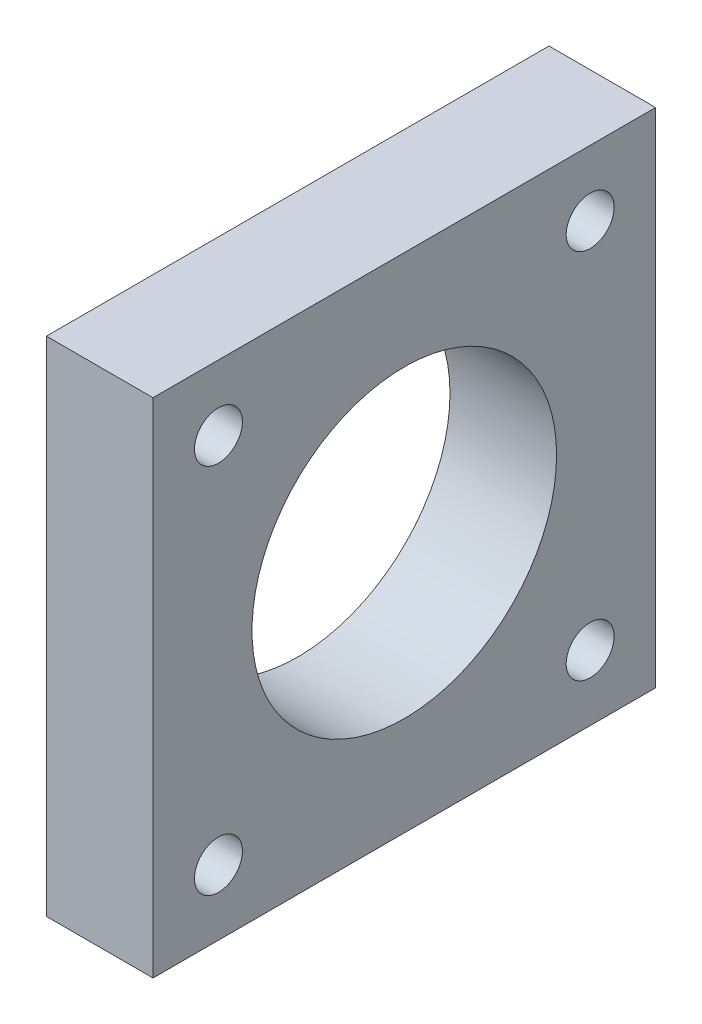
ISO-10303-21;
HEADER;
FILE_DESCRIPTION(('STEP AP214'),'2;1');
FILE_NAME('part.step','',(''),(''),'','','');
FILE_SCHEMA(('AUTOMOTIVE_DESIGN { 1 0 10303 214 1 1 1 1 }'));
ENDSEC;
DATA;
#1=APPLICATION_CONTEXT('core data for automotive mechanical design processes');
#2=APPLICATION_PROTOCOL_DEFINITION('international standard','automotive_design',2000,#1);
#3=PRODUCT_CONTEXT('',#1,'mechanical');
#4=PRODUCT('Part','Part','',(#3));
#5=PRODUCT_RELATED_PRODUCT_CATEGORY('part','',(#4));
#6=PRODUCT_DEFINITION_FORMATION('','',#4);
#7=PRODUCT_DEFINITION_CONTEXT('part definition',#1,'design');
#8=PRODUCT_DEFINITION('design','',#6,#7);
#9=PRODUCT_DEFINITION_SHAPE('','',#8);
#10=(LENGTH_UNIT() NAMED_UNIT(*) SI_UNIT(.MILLI.,.METRE.));
#11=(NAMED_UNIT(*) PLANE_ANGLE_UNIT() SI_UNIT($,.RADIAN.));
#12=(NAMED_UNIT(*) SI_UNIT($,.STERADIAN.) SOLID_ANGLE_UNIT());
#13=UNCERTAINTY_MEASURE_WITH_UNIT(LENGTH_MEASURE(1.E-05),#10,'distance_accuracy_value','');
#14=(GEOMETRIC_REPRESENTATION_CONTEXT(3) GLOBAL_UNCERTAINTY_ASSIGNED_CONTEXT((#13)) GLOBAL_UNIT_ASSIGNED_CONTEXT((#10,
#11,#12)) REPRESENTATION_CONTEXT('',''));
#15=CARTESIAN_POINT('',(0.,0.,0.));
#16=DIRECTION('',(0.,0.,1.));
#17=DIRECTION('',(1.,0.,0.));
#18=AXIS2_PLACEMENT_3D('',#15,#16,#17);
#19=CARTESIAN_POINT('',(8.89,20.955,0.));
#20=DIRECTION('',(0.,-1.,0.));
#21=DIRECTION('',(0.,0.,-1.));
#22=AXIS2_PLACEMENT_3D('',#19,#20,#21);
#23=PLANE('',#22);
#24=DIRECTION('',(0.,0.,1.));
#25=VECTOR('',#24,1.);
#26=CARTESIAN_POINT('',(0.,20.955,0.));
#27=LINE('',#26,#25);
#28=CARTESIAN_POINT('',(0.,20.955,-20.955));
#29=VERTEX_POINT('',#28);
#30=CARTESIAN_POINT('',(0.,20.955,20.955));
#31=VERTEX_POINT('',#30);
#32=EDGE_CURVE('E116',#29,#31,#27,.T.);
#33=ORIENTED_EDGE('',*,*,#32,.T.);
#34=DIRECTION('',(-1.,0.,0.));
#35=VECTOR('',#34,1.);
#36=CARTESIAN_POINT('',(8.89,20.955,20.955));
#37=LINE('',#36,#35);
#38=CARTESIAN_POINT('',(8.89,20.955,20.955));
#39=VERTEX_POINT('',#38);
#40=EDGE_CURVE('E11',#39,#31,#37,.T.);
#41=ORIENTED_EDGE('',*,*,#40,.F.);
#42=DIRECTION('',(0.,0.,1.));
#43=VECTOR('',#42,1.);
#44=CARTESIAN_POINT('',(8.89,20.955,0.));
#45=LINE('',#44,#43);
#46=CARTESIAN_POINT('',(8.89,20.955,-20.955));
#47=VERTEX_POINT('',#46);
#48=EDGE_CURVE('E86',#47,#39,#45,.T.);
#49=ORIENTED_EDGE('',*,*,#48,.F.);
#50=DIRECTION('',(-1.,0.,0.));
#51=VECTOR('',#50,1.);
#52=CARTESIAN_POINT('',(8.89,20.955,-20.955));
#53=LINE('',#52,#51);
#54=EDGE_CURVE('E52',#47,#29,#53,.T.);
#55=ORIENTED_EDGE('',*,*,#54,.T.);
#56=EDGE_LOOP('',(#33,#41,#49,#55));
#57=FACE_BOUND('',#56,.T.);
#58=ADVANCED_FACE('F33',(#57),#23,.F.);
#59=CARTESIAN_POINT('',(8.89,0.,20.955));
#60=DIRECTION('',(0.,0.,-1.));
#61=DIRECTION('',(-1.,0.,0.));
#62=AXIS2_PLACEMENT_3D('',#59,#60,#61);
#63=PLANE('',#62);
#64=DIRECTION('',(0.,-1.,0.));
#65=VECTOR('',#64,1.);
#66=CARTESIAN_POINT('',(0.,0.,20.955));
#67=LINE('',#66,#65);
#68=CARTESIAN_POINT('',(0.,-20.955,20.955));
#69=VERTEX_POINT('',#68);
#70=EDGE_CURVE('E91',#31,#69,#67,.T.);
#71=ORIENTED_EDGE('',*,*,#70,.T.);
#72=DIRECTION('',(-1.,0.,0.));
#73=VECTOR('',#72,1.);
#74=CARTESIAN_POINT('',(8.89,-20.955,20.955));
#75=LINE('',#74,#73);
#76=CARTESIAN_POINT('',(8.89,-20.955,20.955));
#77=VERTEX_POINT('',#76);
#78=EDGE_CURVE('E43',#77,#69,#75,.T.);
#79=ORIENTED_EDGE('',*,*,#78,.F.);
#80=DIRECTION('',(0.,-1.,0.));
#81=VECTOR('',#80,1.);
#82=CARTESIAN_POINT('',(8.89,0.,20.955));
#83=LINE('',#82,#81);
#84=EDGE_CURVE('E77',#39,#77,#83,.T.);
#85=ORIENTED_EDGE('',*,*,#84,.F.);
#86=ORIENTED_EDGE('',*,*,#40,.T.);
#87=EDGE_LOOP('',(#71,#79,#85,#86));
#88=FACE_BOUND('',#87,.T.);
#89=ADVANCED_FACE('F90',(#88),#63,.F.);
#90=CARTESIAN_POINT('',(8.89,-20.955,0.));
#91=DIRECTION('',(0.,-1.,0.));
#92=DIRECTION('',(0.,0.,-1.));
#93=AXIS2_PLACEMENT_3D('',#90,#91,#92);
#94=PLANE('',#93);
#95=DIRECTION('',(0.,0.,1.));
#96=VECTOR('',#95,1.);
#97=CARTESIAN_POINT('',(0.,-20.955,0.));
#98=LINE('',#97,#96);
#99=CARTESIAN_POINT('',(0.,-20.955,-20.955));
#100=VERTEX_POINT('',#99);
#101=EDGE_CURVE('E120',#100,#69,#98,.T.);
#102=ORIENTED_EDGE('',*,*,#101,.F.);
#103=DIRECTION('',(-1.,0.,0.));
#104=VECTOR('',#103,1.);
#105=CARTESIAN_POINT('',(8.89,-20.955,-20.955));
#106=LINE('',#105,#104);
#107=CARTESIAN_POINT('',(8.89,-20.955,-20.955));
#108=VERTEX_POINT('',#107);
#109=EDGE_CURVE('E66',#108,#100,#106,.T.);
#110=ORIENTED_EDGE('',*,*,#109,.F.);
#111=DIRECTION('',(0.,0.,1.));
#112=VECTOR('',#111,1.);
#113=CARTESIAN_POINT('',(8.89,-20.955,0.));
#114=LINE('',#113,#112);
#115=EDGE_CURVE('E85',#108,#77,#114,.T.);
#116=ORIENTED_EDGE('',*,*,#115,.T.);
#117=ORIENTED_EDGE('',*,*,#78,.T.);
#118=EDGE_LOOP('',(#102,#110,#116,#117));
#119=FACE_BOUND('',#118,.T.);
#120=ADVANCED_FACE('F95',(#119),#94,.T.);
#121=CARTESIAN_POINT('',(8.89,-15.5,15.5));
#122=DIRECTION('',(-1.,0.,0.));
#123=DIRECTION('',(0.,0.,1.));
#124=AXIS2_PLACEMENT_3D('',#121,#122,#123);
#125=CYLINDRICAL_SURFACE('',#124,2.);
#126=CARTESIAN_POINT('',(4.000000128,-15.5,15.5));
#127=DIRECTION('',(1.,0.,0.));
#128=DIRECTION('',(0.,0.,-1.));
#129=AXIS2_PLACEMENT_3D('',#126,#127,#128);
#130=CIRCLE('',#129,2.);
#131=CARTESIAN_POINT('',(4.000000128,-15.5,13.5));
#132=VERTEX_POINT('',#131);
#133=EDGE_CURVE('E37',#132,#132,#130,.T.);
#134=ORIENTED_EDGE('',*,*,#133,.F.);
#135=EDGE_LOOP('',(#134));
#136=FACE_BOUND('',#135,.T.);
#137=CARTESIAN_POINT('',(8.89,-15.5,15.5));
#138=DIRECTION('',(1.,0.,0.));
#139=DIRECTION('',(0.,0.,-1.));
#140=AXIS2_PLACEMENT_3D('',#137,#138,#139);
#141=CIRCLE('',#140,2.);
#142=CARTESIAN_POINT('',(8.89,-15.5,13.5));
#143=VERTEX_POINT('',#142);
#144=EDGE_CURVE('E107',#143,#143,#141,.T.);
#145=ORIENTED_EDGE('',*,*,#144,.T.);
#146=EDGE_LOOP('',(#145));
#147=FACE_BOUND('',#146,.T.);
#148=ADVANCED_FACE('F177',(#136,#147),#125,.F.);
#149=CARTESIAN_POINT('',(8.89,15.5,15.5));
#150=DIRECTION('',(-1.,0.,0.));
#151=DIRECTION('',(0.,0.,1.));
#152=AXIS2_PLACEMENT_3D('',#149,#150,#151);
#153=CYLINDRICAL_SURFACE('',#152,1.99999999999999);
#154=CARTESIAN_POINT('',(4.000000128,15.5,15.5));
#155=DIRECTION('',(1.,0.,0.));
#156=DIRECTION('',(0.,0.,-1.));
#157=AXIS2_PLACEMENT_3D('',#154,#155,#156);
#158=CIRCLE('',#157,1.99999999999999);
#159=CARTESIAN_POINT('',(4.000000128,15.5,13.5));
#160=VERTEX_POINT('',#159);
#161=EDGE_CURVE('E133',#160,#160,#158,.T.);
#162=ORIENTED_EDGE('',*,*,#161,.F.);
#163=EDGE_LOOP('',(#162));
#164=FACE_BOUND('',#163,.T.);
#165=CARTESIAN_POINT('',(8.89,15.5,15.5));
#166=DIRECTION('',(1.,0.,0.));
#167=DIRECTION('',(0.,0.,-1.));
#168=AXIS2_PLACEMENT_3D('',#165,#166,#167);
#169=CIRCLE('',#168,1.99999999999999);
#170=CARTESIAN_POINT('',(8.89,15.5,13.5));
#171=VERTEX_POINT('',#170);
#172=EDGE_CURVE('E104',#171,#171,#169,.T.);
#173=ORIENTED_EDGE('',*,*,#172,.T.);
#174=EDGE_LOOP('',(#173));
#175=FACE_BOUND('',#174,.T.);
#176=ADVANCED_FACE('F184',(#164,#175),#153,.F.);
#177=CARTESIAN_POINT('',(8.89,15.5,-15.5));
#178=DIRECTION('',(-1.,0.,0.));
#179=DIRECTION('',(0.,0.,1.));
#180=AXIS2_PLACEMENT_3D('',#177,#178,#179);
#181=CYLINDRICAL_SURFACE('',#180,2.);
#182=CARTESIAN_POINT('',(4.000000128,15.5,-15.5));
#183=DIRECTION('',(1.,0.,0.));
#184=DIRECTION('',(0.,0.,-1.));
#185=AXIS2_PLACEMENT_3D('',#182,#183,#184);
#186=CIRCLE('',#185,2.);
#187=CARTESIAN_POINT('',(4.000000128,15.5,-17.5));
#188=VERTEX_POINT('',#187);
#189=EDGE_CURVE('E117',#188,#188,#186,.T.);
#190=ORIENTED_EDGE('',*,*,#189,.F.);
#191=EDGE_LOOP('',(#190));
#192=FACE_BOUND('',#191,.T.);
#193=CARTESIAN_POINT('',(8.89,15.5,-15.5));
#194=DIRECTION('',(1.,0.,0.));
#195=DIRECTION('',(0.,0.,-1.));
#196=AXIS2_PLACEMENT_3D('',#193,#194,#195);
#197=CIRCLE('',#196,2.);
#198=CARTESIAN_POINT('',(8.89,15.5,-17.5));
#199=VERTEX_POINT('',#198);
#200=EDGE_CURVE('E98',#199,#199,#197,.T.);
#201=ORIENTED_EDGE('',*,*,#200,.T.);
#202=EDGE_LOOP('',(#201));
#203=FACE_BOUND('',#202,.T.);
#204=ADVANCED_FACE('F181',(#192,#203),#181,.F.);
#205=CARTESIAN_POINT('',(8.89,0.,-20.955));
#206=DIRECTION('',(0.,0.,-1.));
#207=DIRECTION('',(0.,1.,0.));
#208=AXIS2_PLACEMENT_3D('',#205,#206,#207);
#209=PLANE('',#208);
#210=DIRECTION('',(0.,-1.,0.));
#211=VECTOR('',#210,1.);
#212=CARTESIAN_POINT('',(0.,0.,-20.955));
#213=LINE('',#212,#211);
#214=EDGE_CURVE('E122',#29,#100,#213,.T.);
#215=ORIENTED_EDGE('',*,*,#214,.F.);
#216=ORIENTED_EDGE('',*,*,#54,.F.);
#217=DIRECTION('',(0.,-1.,0.));
#218=VECTOR('',#217,1.);
#219=CARTESIAN_POINT('',(8.89,0.,-20.955));
#220=LINE('',#219,#218);
#221=EDGE_CURVE('E96',#47,#108,#220,.T.);
#222=ORIENTED_EDGE('',*,*,#221,.T.);
#223=ORIENTED_EDGE('',*,*,#109,.T.);
#224=EDGE_LOOP('',(#215,#216,#222,#223));
#225=FACE_BOUND('',#224,.T.);
#226=ADVANCED_FACE('F178',(#225),#209,.T.);
#227=CARTESIAN_POINT('',(8.89,0.,0.));
#228=DIRECTION('',(-1.,0.,0.));
#229=DIRECTION('',(0.,0.,1.));
#230=AXIS2_PLACEMENT_3D('',#227,#228,#229);
#231=CYLINDRICAL_SURFACE('',#230,12.7);
#232=CARTESIAN_POINT('',(8.89,0.,0.));
#233=DIRECTION('',(1.,0.,0.));
#234=DIRECTION('',(0.,0.,-1.));
#235=AXIS2_PLACEMENT_3D('',#232,#233,#234);
#236=CIRCLE('',#235,12.7);
#237=CARTESIAN_POINT('',(8.89,0.,-12.7));
#238=VERTEX_POINT('',#237);
#239=EDGE_CURVE('E125',#238,#238,#236,.T.);
#240=ORIENTED_EDGE('',*,*,#239,.T.);
#241=EDGE_LOOP('',(#240));
#242=FACE_BOUND('',#241,.T.);
#243=CARTESIAN_POINT('',(0.,0.,0.));
#244=DIRECTION('',(1.,0.,0.));
#245=DIRECTION('',(0.,0.,-1.));
#246=AXIS2_PLACEMENT_3D('',#243,#244,#245);
#247=CIRCLE('',#246,12.7);
#248=CARTESIAN_POINT('',(0.,0.,-12.7));
#249=VERTEX_POINT('',#248);
#250=EDGE_CURVE('E113',#249,#249,#247,.T.);
#251=ORIENTED_EDGE('',*,*,#250,.F.);
#252=EDGE_LOOP('',(#251));
#253=FACE_BOUND('',#252,.T.);
#254=ADVANCED_FACE('F35',(#242,#253),#231,.F.);
#255=CARTESIAN_POINT('',(8.89,-15.5,-15.5));
#256=DIRECTION('',(-1.,0.,0.));
#257=DIRECTION('',(0.,0.,1.));
#258=AXIS2_PLACEMENT_3D('',#255,#256,#257);
#259=CYLINDRICAL_SURFACE('',#258,2.);
#260=CARTESIAN_POINT('',(4.000000128,-15.5,-15.5));
#261=DIRECTION('',(1.,0.,0.));
#262=DIRECTION('',(0.,0.,-1.));
#263=AXIS2_PLACEMENT_3D('',#260,#261,#262);
#264=CIRCLE('',#263,2.);
#265=CARTESIAN_POINT('',(4.000000128,-15.5,-17.5));
#266=VERTEX_POINT('',#265);
#267=EDGE_CURVE('E131',#266,#266,#264,.T.);
#268=ORIENTED_EDGE('',*,*,#267,.F.);
#269=EDGE_LOOP('',(#268));
#270=FACE_BOUND('',#269,.T.);
#271=CARTESIAN_POINT('',(8.89,-15.5,-15.5));
#272=DIRECTION('',(1.,0.,0.));
#273=DIRECTION('',(0.,0.,-1.));
#274=AXIS2_PLACEMENT_3D('',#271,#272,#273);
#275=CIRCLE('',#274,2.);
#276=CARTESIAN_POINT('',(8.89,-15.5,-17.5));
#277=VERTEX_POINT('',#276);
#278=EDGE_CURVE('E110',#277,#277,#275,.T.);
#279=ORIENTED_EDGE('',*,*,#278,.T.);
#280=EDGE_LOOP('',(#279));
#281=FACE_BOUND('',#280,.T.);
#282=ADVANCED_FACE('F157',(#270,#281),#259,.F.);
#283=CARTESIAN_POINT('',(8.89,0.,0.));
#284=DIRECTION('',(1.,0.,0.));
#285=DIRECTION('',(0.,0.,-1.));
#286=AXIS2_PLACEMENT_3D('',#283,#284,#285);
#287=PLANE('',#286);
#288=ORIENTED_EDGE('',*,*,#239,.F.);
#289=EDGE_LOOP('',(#288));
#290=FACE_BOUND('',#289,.T.);
#291=ORIENTED_EDGE('',*,*,#48,.T.);
#292=ORIENTED_EDGE('',*,*,#84,.T.);
#293=ORIENTED_EDGE('',*,*,#115,.F.);
#294=ORIENTED_EDGE('',*,*,#221,.F.);
#295=EDGE_LOOP('',(#291,#292,#293,#294));
#296=FACE_BOUND('',#295,.T.);
#297=ORIENTED_EDGE('',*,*,#200,.F.);
#298=EDGE_LOOP('',(#297));
#299=FACE_BOUND('',#298,.T.);
#300=ORIENTED_EDGE('',*,*,#172,.F.);
#301=EDGE_LOOP('',(#300));
#302=FACE_BOUND('',#301,.T.);
#303=ORIENTED_EDGE('',*,*,#144,.F.);
#304=EDGE_LOOP('',(#303));
#305=FACE_BOUND('',#304,.T.);
#306=ORIENTED_EDGE('',*,*,#278,.F.);
#307=EDGE_LOOP('',(#306));
#308=FACE_BOUND('',#307,.T.);
#309=ADVANCED_FACE('F81',(#290,#296,#299,#302,#305,#308),#287,.T.);
#310=CARTESIAN_POINT('',(0.,0.,0.));
#311=DIRECTION('',(1.,0.,0.));
#312=DIRECTION('',(0.,0.,-1.));
#313=AXIS2_PLACEMENT_3D('',#310,#311,#312);
#314=PLANE('',#313);
#315=CARTESIAN_POINT('',(0.,15.5,15.5));
#316=DIRECTION('',(1.,0.,0.));
#317=DIRECTION('',(0.,0.,-1.));
#318=AXIS2_PLACEMENT_3D('',#315,#316,#317);
#319=CIRCLE('',#318,2.99999996899998);
#320=CARTESIAN_POINT('',(0.,15.5,12.500000031));
#321=VERTEX_POINT('',#320);
#322=EDGE_CURVE('E134',#321,#321,#319,.T.);
#323=ORIENTED_EDGE('',*,*,#322,.T.);
#324=EDGE_LOOP('',(#323));
#325=FACE_BOUND('',#324,.T.);
#326=CARTESIAN_POINT('',(0.,-15.5,15.5));
#327=DIRECTION('',(1.,0.,0.));
#328=DIRECTION('',(0.,0.,-1.));
#329=AXIS2_PLACEMENT_3D('',#326,#327,#328);
#330=CIRCLE('',#329,2.99999996899999);
#331=CARTESIAN_POINT('',(0.,-15.5,12.500000031));
#332=VERTEX_POINT('',#331);
#333=EDGE_CURVE('E314',#332,#332,#330,.T.);
#334=ORIENTED_EDGE('',*,*,#333,.T.);
#335=EDGE_LOOP('',(#334));
#336=FACE_BOUND('',#335,.T.);
#337=CARTESIAN_POINT('',(0.,-15.5,-15.5));
#338=DIRECTION('',(1.,0.,0.));
#339=DIRECTION('',(0.,0.,-1.));
#340=AXIS2_PLACEMENT_3D('',#337,#338,#339);
#341=CIRCLE('',#340,2.99999996899999);
#342=CARTESIAN_POINT('',(0.,-15.5,-18.499999969));
#343=VERTEX_POINT('',#342);
#344=EDGE_CURVE('E324',#343,#343,#341,.T.);
#345=ORIENTED_EDGE('',*,*,#344,.T.);
#346=EDGE_LOOP('',(#345));
#347=FACE_BOUND('',#346,.T.);
#348=CARTESIAN_POINT('',(0.,15.5,-15.5));
#349=DIRECTION('',(1.,0.,0.));
#350=DIRECTION('',(0.,0.,-1.));
#351=AXIS2_PLACEMENT_3D('',#348,#349,#350);
#352=CIRCLE('',#351,2.99999996899999);
#353=CARTESIAN_POINT('',(0.,15.5,-18.499999969));
#354=VERTEX_POINT('',#353);
#355=EDGE_CURVE('E139',#354,#354,#352,.T.);
#356=ORIENTED_EDGE('',*,*,#355,.T.);
#357=EDGE_LOOP('',(#356));
#358=FACE_BOUND('',#357,.T.);
#359=ORIENTED_EDGE('',*,*,#250,.T.);
#360=EDGE_LOOP('',(#359));
#361=FACE_BOUND('',#360,.T.);
#362=ORIENTED_EDGE('',*,*,#32,.F.);
#363=ORIENTED_EDGE('',*,*,#214,.T.);
#364=ORIENTED_EDGE('',*,*,#101,.T.);
#365=ORIENTED_EDGE('',*,*,#70,.F.);
#366=EDGE_LOOP('',(#362,#363,#364,#365));
#367=FACE_BOUND('',#366,.T.);
#368=ADVANCED_FACE('F156',(#325,#336,#347,#358,#361,#367),#314,.F.);
#369=CARTESIAN_POINT('',(4.000000128,15.5,-15.5));
#370=DIRECTION('',(-1.,0.,0.));
#371=DIRECTION('',(0.,0.,1.));
#372=AXIS2_PLACEMENT_3D('',#369,#370,#371);
#373=CYLINDRICAL_SURFACE('',#372,2.99999996899999);
#374=CARTESIAN_POINT('',(4.000000128,15.5,-15.5));
#375=DIRECTION('',(1.,0.,0.));
#376=DIRECTION('',(0.,0.,-1.));
#377=AXIS2_PLACEMENT_3D('',#374,#375,#376);
#378=CIRCLE('',#377,2.99999996899999);
#379=CARTESIAN_POINT('',(4.000000128,15.5,-18.499999969));
#380=VERTEX_POINT('',#379);
#381=EDGE_CURVE('E130',#380,#380,#378,.T.);
#382=ORIENTED_EDGE('',*,*,#381,.T.);
#383=EDGE_LOOP('',(#382));
#384=FACE_BOUND('',#383,.T.);
#385=ORIENTED_EDGE('',*,*,#355,.F.);
#386=EDGE_LOOP('',(#385));
#387=FACE_BOUND('',#386,.T.);
#388=ADVANCED_FACE('F163',(#384,#387),#373,.F.);
#389=CARTESIAN_POINT('',(4.000000128,15.5,-15.5));
#390=DIRECTION('',(1.,0.,0.));
#391=DIRECTION('',(0.,0.,-1.));
#392=AXIS2_PLACEMENT_3D('',#389,#390,#391);
#393=PLANE('',#392);
#394=ORIENTED_EDGE('',*,*,#189,.T.);
#395=EDGE_LOOP('',(#394));
#396=FACE_BOUND('',#395,.T.);
#397=ORIENTED_EDGE('',*,*,#381,.F.);
#398=EDGE_LOOP('',(#397));
#399=FACE_BOUND('',#398,.T.);
#400=ADVANCED_FACE('F239',(#396,#399),#393,.F.);
#401=CARTESIAN_POINT('',(4.000000128,-15.5,-15.5));
#402=DIRECTION('',(-1.,0.,0.));
#403=DIRECTION('',(0.,0.,1.));
#404=AXIS2_PLACEMENT_3D('',#401,#402,#403);
#405=CYLINDRICAL_SURFACE('',#404,2.99999996899999);
#406=CARTESIAN_POINT('',(4.000000128,-15.5,-15.5));
#407=DIRECTION('',(1.,0.,0.));
#408=DIRECTION('',(0.,0.,-1.));
#409=AXIS2_PLACEMENT_3D('',#406,#407,#408);
#410=CIRCLE('',#409,2.99999996899999);
#411=CARTESIAN_POINT('',(4.000000128,-15.5,-18.499999969));
#412=VERTEX_POINT('',#411);
#413=EDGE_CURVE('E326',#412,#412,#410,.T.);
#414=ORIENTED_EDGE('',*,*,#413,.T.);
#415=EDGE_LOOP('',(#414));
#416=FACE_BOUND('',#415,.T.);
#417=ORIENTED_EDGE('',*,*,#344,.F.);
#418=EDGE_LOOP('',(#417));
#419=FACE_BOUND('',#418,.T.);
#420=ADVANCED_FACE('F248',(#416,#419),#405,.F.);
#421=CARTESIAN_POINT('',(4.000000128,-15.5,-15.5));
#422=DIRECTION('',(1.,0.,0.));
#423=DIRECTION('',(0.,0.,-1.));
#424=AXIS2_PLACEMENT_3D('',#421,#422,#423);
#425=PLANE('',#424);
#426=ORIENTED_EDGE('',*,*,#267,.T.);
#427=EDGE_LOOP('',(#426));
#428=FACE_BOUND('',#427,.T.);
#429=ORIENTED_EDGE('',*,*,#413,.F.);
#430=EDGE_LOOP('',(#429));
#431=FACE_BOUND('',#430,.T.);
#432=ADVANCED_FACE('F258',(#428,#431),#425,.F.);
#433=CARTESIAN_POINT('',(4.000000128,-15.5,15.5));
#434=DIRECTION('',(-1.,0.,0.));
#435=DIRECTION('',(0.,0.,1.));
#436=AXIS2_PLACEMENT_3D('',#433,#434,#435);
#437=CYLINDRICAL_SURFACE('',#436,2.99999996899999);
#438=CARTESIAN_POINT('',(4.000000128,-15.5,15.5));
#439=DIRECTION('',(1.,0.,0.));
#440=DIRECTION('',(0.,0.,-1.));
#441=AXIS2_PLACEMENT_3D('',#438,#439,#440);
#442=CIRCLE('',#441,2.99999996899999);
#443=CARTESIAN_POINT('',(4.000000128,-15.5,12.500000031));
#444=VERTEX_POINT('',#443);
#445=EDGE_CURVE('E319',#444,#444,#442,.T.);
#446=ORIENTED_EDGE('',*,*,#445,.T.);
#447=EDGE_LOOP('',(#446));
#448=FACE_BOUND('',#447,.T.);
#449=ORIENTED_EDGE('',*,*,#333,.F.);
#450=EDGE_LOOP('',(#449));
#451=FACE_BOUND('',#450,.T.);
#452=ADVANCED_FACE('F268',(#448,#451),#437,.F.);
#453=CARTESIAN_POINT('',(4.000000128,-15.5,15.5));
#454=DIRECTION('',(1.,0.,0.));
#455=DIRECTION('',(0.,0.,-1.));
#456=AXIS2_PLACEMENT_3D('',#453,#454,#455);
#457=PLANE('',#456);
#458=ORIENTED_EDGE('',*,*,#133,.T.);
#459=EDGE_LOOP('',(#458));
#460=FACE_BOUND('',#459,.T.);
#461=ORIENTED_EDGE('',*,*,#445,.F.);
#462=EDGE_LOOP('',(#461));
#463=FACE_BOUND('',#462,.T.);
#464=ADVANCED_FACE('F278',(#460,#463),#457,.F.);
#465=CARTESIAN_POINT('',(4.000000128,15.5,15.5));
#466=DIRECTION('',(-1.,0.,0.));
#467=DIRECTION('',(0.,0.,1.));
#468=AXIS2_PLACEMENT_3D('',#465,#466,#467);
#469=CYLINDRICAL_SURFACE('',#468,2.99999996899998);
#470=CARTESIAN_POINT('',(4.000000128,15.5,15.5));
#471=DIRECTION('',(1.,0.,0.));
#472=DIRECTION('',(0.,0.,-1.));
#473=AXIS2_PLACEMENT_3D('',#470,#471,#472);
#474=CIRCLE('',#473,2.99999996899998);
#475=CARTESIAN_POINT('',(4.000000128,15.5,12.500000031));
#476=VERTEX_POINT('',#475);
#477=EDGE_CURVE('E313',#476,#476,#474,.T.);
#478=ORIENTED_EDGE('',*,*,#477,.T.);
#479=EDGE_LOOP('',(#478));
#480=FACE_BOUND('',#479,.T.);
#481=ORIENTED_EDGE('',*,*,#322,.F.);
#482=EDGE_LOOP('',(#481));
#483=FACE_BOUND('',#482,.T.);
#484=ADVANCED_FACE('F288',(#480,#483),#469,.F.);
#485=CARTESIAN_POINT('',(4.000000128,15.5,15.5));
#486=DIRECTION('',(1.,0.,0.));
#487=DIRECTION('',(0.,0.,-1.));
#488=AXIS2_PLACEMENT_3D('',#485,#486,#487);
#489=PLANE('',#488);
#490=ORIENTED_EDGE('',*,*,#161,.T.);
#491=EDGE_LOOP('',(#490));
#492=FACE_BOUND('',#491,.T.);
#493=ORIENTED_EDGE('',*,*,#477,.F.);
#494=EDGE_LOOP('',(#493));
#495=FACE_BOUND('',#494,.T.);
#496=ADVANCED_FACE('F297',(#492,#495),#489,.F.);
#497=CLOSED_SHELL('',(#58,#89,#120,#148,#176,#204,#226,#254,#282,#309,#368,#388,#400,#420,#432,
#452,#464,#484,#496));
#498=MANIFOLD_SOLID_BREP('B2',#497);
#499=ADVANCED_BREP_SHAPE_REPRESENTATION('',(#18,#498),#14);
#500=SHAPE_DEFINITION_REPRESENTATION(#9,#499);
ENDSEC;
END-ISO-10303-21;
